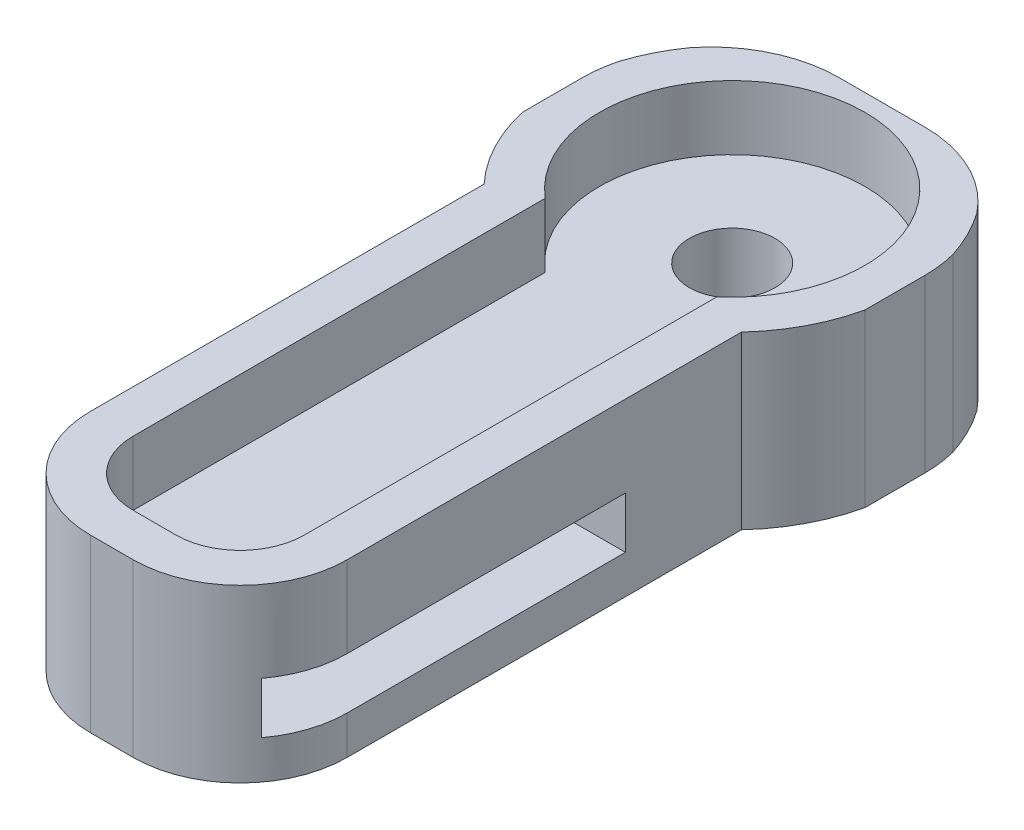
ISO-10303-21;
HEADER;
FILE_DESCRIPTION(('STEP AP214'),'2;1');
FILE_NAME('part.step','',(''),(''),'','','');
FILE_SCHEMA(('AUTOMOTIVE_DESIGN { 1 0 10303 214 1 1 1 1 }'));
ENDSEC;
DATA;
#1=APPLICATION_CONTEXT('core data for automotive mechanical design processes');
#2=APPLICATION_PROTOCOL_DEFINITION('international standard','automotive_design',2000,#1);
#3=PRODUCT_CONTEXT('',#1,'mechanical');
#4=PRODUCT('Part','Part','',(#3));
#5=PRODUCT_RELATED_PRODUCT_CATEGORY('part','',(#4));
#6=PRODUCT_DEFINITION_FORMATION('','',#4);
#7=PRODUCT_DEFINITION_CONTEXT('part definition',#1,'design');
#8=PRODUCT_DEFINITION('design','',#6,#7);
#9=PRODUCT_DEFINITION_SHAPE('','',#8);
#10=(LENGTH_UNIT() NAMED_UNIT(*) SI_UNIT(.MILLI.,.METRE.));
#11=(NAMED_UNIT(*) PLANE_ANGLE_UNIT() SI_UNIT($,.RADIAN.));
#12=(NAMED_UNIT(*) SI_UNIT($,.STERADIAN.) SOLID_ANGLE_UNIT());
#13=UNCERTAINTY_MEASURE_WITH_UNIT(LENGTH_MEASURE(1.E-05),#10,'distance_accuracy_value','');
#14=(GEOMETRIC_REPRESENTATION_CONTEXT(3) GLOBAL_UNCERTAINTY_ASSIGNED_CONTEXT((#13)) GLOBAL_UNIT_ASSIGNED_CONTEXT((#10,
#11,#12)) REPRESENTATION_CONTEXT('',''));
#15=CARTESIAN_POINT('',(0.,0.,0.));
#16=DIRECTION('',(0.,0.,1.));
#17=DIRECTION('',(1.,0.,0.));
#18=AXIS2_PLACEMENT_3D('',#15,#16,#17);
#19=CARTESIAN_POINT('',(4.,4.,9.));
#20=DIRECTION('',(0.,0.,-1.));
#21=DIRECTION('',(-1.,0.,0.));
#22=AXIS2_PLACEMENT_3D('',#19,#20,#21);
#23=PLANE('',#22);
#24=DIRECTION('',(1.,0.,0.));
#25=VECTOR('',#24,1.);
#26=CARTESIAN_POINT('',(4.,0.,9.));
#27=LINE('',#26,#25);
#28=CARTESIAN_POINT('',(-0.494386127514467,0.,9.));
#29=VERTEX_POINT('',#28);
#30=CARTESIAN_POINT('',(0.505613872485533,0.,9.));
#31=VERTEX_POINT('',#30);
#32=EDGE_CURVE('E319',#29,#31,#27,.T.);
#33=ORIENTED_EDGE('',*,*,#32,.T.);
#34=DIRECTION('',(0.,-1.,0.));
#35=VECTOR('',#34,1.);
#36=CARTESIAN_POINT('',(0.505613872485533,34.1246890528022,9.));
#37=LINE('',#36,#35);
#38=CARTESIAN_POINT('',(0.505613872485533,4.,9.));
#39=VERTEX_POINT('',#38);
#40=EDGE_CURVE('E283',#39,#31,#37,.T.);
#41=ORIENTED_EDGE('',*,*,#40,.F.);
#42=DIRECTION('',(1.,0.,0.));
#43=VECTOR('',#42,1.);
#44=CARTESIAN_POINT('',(4.,4.,9.));
#45=LINE('',#44,#43);
#46=CARTESIAN_POINT('',(-0.494386127514467,4.,9.));
#47=VERTEX_POINT('',#46);
#48=EDGE_CURVE('E474',#47,#39,#45,.T.);
#49=ORIENTED_EDGE('',*,*,#48,.F.);
#50=DIRECTION('',(0.,-1.,0.));
#51=VECTOR('',#50,1.);
#52=CARTESIAN_POINT('',(-0.494386127514467,34.1246890528022,9.));
#53=LINE('',#52,#51);
#54=EDGE_CURVE('E247',#47,#29,#53,.T.);
#55=ORIENTED_EDGE('',*,*,#54,.T.);
#56=EDGE_LOOP('',(#33,#41,#49,#55));
#57=FACE_BOUND('',#56,.T.);
#58=ADVANCED_FACE('F39',(#57),#23,.F.);
#59=CARTESIAN_POINT('',(1.,4.,-6.));
#60=DIRECTION('',(0.,-1.,0.));
#61=DIRECTION('',(0.,0.,-1.));
#62=AXIS2_PLACEMENT_3D('',#59,#60,#61);
#63=CYLINDRICAL_SURFACE('',#62,3.);
#64=DIRECTION('',(0.,-1.,0.));
#65=VECTOR('',#64,1.);
#66=CARTESIAN_POINT('',(3.34354322971269,4.,-7.87291354057464));
#67=LINE('',#66,#65);
#68=CARTESIAN_POINT('',(3.34354322971269,0.,-7.87291354057464));
#69=VERTEX_POINT('',#68);
#70=CARTESIAN_POINT('',(3.34354322971269,4.,-7.87291354057464));
#71=VERTEX_POINT('',#70);
#72=EDGE_CURVE('E286',#69,#71,#67,.F.);
#73=ORIENTED_EDGE('',*,*,#72,.F.);
#74=CARTESIAN_POINT('',(1.,0.,-6.));
#75=DIRECTION('',(0.,1.,0.));
#76=DIRECTION('',(0.,0.,1.));
#77=AXIS2_PLACEMENT_3D('',#74,#75,#76);
#78=CIRCLE('',#77,3.);
#79=CARTESIAN_POINT('',(1.,0.,-9.));
#80=VERTEX_POINT('',#79);
#81=EDGE_CURVE('E351',#80,#69,#78,.F.);
#82=ORIENTED_EDGE('',*,*,#81,.F.);
#83=DIRECTION('',(0.,-1.,0.));
#84=VECTOR('',#83,1.);
#85=CARTESIAN_POINT('',(1.,4.,-9.));
#86=LINE('',#85,#84);
#87=CARTESIAN_POINT('',(1.,4.,-9.));
#88=VERTEX_POINT('',#87);
#89=EDGE_CURVE('E342',#88,#80,#86,.T.);
#90=ORIENTED_EDGE('',*,*,#89,.F.);
#91=CARTESIAN_POINT('',(1.,4.,-6.));
#92=DIRECTION('',(0.,1.,0.));
#93=DIRECTION('',(0.,0.,1.));
#94=AXIS2_PLACEMENT_3D('',#91,#92,#93);
#95=CIRCLE('',#94,3.);
#96=EDGE_CURVE('E363',#71,#88,#95,.T.);
#97=ORIENTED_EDGE('',*,*,#96,.F.);
#98=EDGE_LOOP('',(#73,#82,#90,#97));
#99=FACE_BOUND('',#98,.T.);
#100=ADVANCED_FACE('F593',(#99),#63,.T.);
#101=CARTESIAN_POINT('',(-1.,4.,-6.));
#102=DIRECTION('',(0.,-1.,0.));
#103=DIRECTION('',(0.,0.,-1.));
#104=AXIS2_PLACEMENT_3D('',#101,#102,#103);
#105=CYLINDRICAL_SURFACE('',#104,3.);
#106=DIRECTION('',(0.,-1.,0.));
#107=VECTOR('',#106,1.);
#108=CARTESIAN_POINT('',(-3.90445677028733,4.,-6.75108645942533));
#109=LINE('',#108,#107);
#110=CARTESIAN_POINT('',(-3.90445677028733,0.,-6.75108645942533));
#111=VERTEX_POINT('',#110);
#112=CARTESIAN_POINT('',(-3.90445677028733,4.,-6.75108645942533));
#113=VERTEX_POINT('',#112);
#114=EDGE_CURVE('E399',#111,#113,#109,.F.);
#115=ORIENTED_EDGE('',*,*,#114,.F.);
#116=CARTESIAN_POINT('',(-1.,0.,-6.));
#117=DIRECTION('',(0.,1.,0.));
#118=DIRECTION('',(0.,0.,1.));
#119=AXIS2_PLACEMENT_3D('',#116,#117,#118);
#120=CIRCLE('',#119,3.);
#121=CARTESIAN_POINT('',(-4.,0.,-6.));
#122=VERTEX_POINT('',#121);
#123=EDGE_CURVE('E347',#122,#111,#120,.F.);
#124=ORIENTED_EDGE('',*,*,#123,.F.);
#125=DIRECTION('',(0.,-1.,0.));
#126=VECTOR('',#125,1.);
#127=CARTESIAN_POINT('',(-4.,4.,-6.));
#128=LINE('',#127,#126);
#129=CARTESIAN_POINT('',(-4.,4.,-6.));
#130=VERTEX_POINT('',#129);
#131=EDGE_CURVE('E317',#130,#122,#128,.T.);
#132=ORIENTED_EDGE('',*,*,#131,.F.);
#133=CARTESIAN_POINT('',(-1.,4.,-6.));
#134=DIRECTION('',(0.,1.,0.));
#135=DIRECTION('',(0.,0.,1.));
#136=AXIS2_PLACEMENT_3D('',#133,#134,#135);
#137=CIRCLE('',#136,3.);
#138=EDGE_CURVE('E358',#113,#130,#137,.T.);
#139=ORIENTED_EDGE('',*,*,#138,.F.);
#140=EDGE_LOOP('',(#115,#124,#132,#139));
#141=FACE_BOUND('',#140,.T.);
#142=ADVANCED_FACE('F495',(#141),#105,.T.);
#143=CARTESIAN_POINT('',(-4.,4.,9.));
#144=DIRECTION('',(1.,0.,0.));
#145=DIRECTION('',(0.,0.,-1.));
#146=AXIS2_PLACEMENT_3D('',#143,#144,#145);
#147=PLANE('',#146);
#148=DIRECTION('',(0.,0.,1.));
#149=VECTOR('',#148,1.);
#150=CARTESIAN_POINT('',(-4.,0.,9.));
#151=LINE('',#150,#149);
#152=CARTESIAN_POINT('',(-4.,0.,-4.6));
#153=VERTEX_POINT('',#152);
#154=EDGE_CURVE('E311',#122,#153,#151,.T.);
#155=ORIENTED_EDGE('',*,*,#154,.T.);
#156=DIRECTION('',(0.,-1.,0.));
#157=VECTOR('',#156,1.);
#158=CARTESIAN_POINT('',(-4.,34.1246890528022,-4.6));
#159=LINE('',#158,#157);
#160=CARTESIAN_POINT('',(-4.,4.,-4.6));
#161=VERTEX_POINT('',#160);
#162=EDGE_CURVE('E256',#153,#161,#159,.F.);
#163=ORIENTED_EDGE('',*,*,#162,.T.);
#164=DIRECTION('',(0.,0.,1.));
#165=VECTOR('',#164,1.);
#166=CARTESIAN_POINT('',(-4.,4.,9.));
#167=LINE('',#166,#165);
#168=EDGE_CURVE('E253',#130,#161,#167,.T.);
#169=ORIENTED_EDGE('',*,*,#168,.F.);
#170=ORIENTED_EDGE('',*,*,#131,.T.);
#171=EDGE_LOOP('',(#155,#163,#169,#170));
#172=FACE_BOUND('',#171,.T.);
#173=ADVANCED_FACE('F315',(#172),#147,.F.);
#174=CARTESIAN_POINT('',(4.,4.,9.));
#175=DIRECTION('',(-1.,0.,0.));
#176=DIRECTION('',(0.,0.,1.));
#177=AXIS2_PLACEMENT_3D('',#174,#175,#176);
#178=PLANE('',#177);
#179=DIRECTION('',(0.,0.,-1.));
#180=VECTOR('',#179,1.);
#181=CARTESIAN_POINT('',(4.,4.,9.));
#182=LINE('',#181,#180);
#183=CARTESIAN_POINT('',(4.,4.,-4.59999999999999));
#184=VERTEX_POINT('',#183);
#185=CARTESIAN_POINT('',(4.,4.,-6.));
#186=VERTEX_POINT('',#185);
#187=EDGE_CURVE('E477',#184,#186,#182,.T.);
#188=ORIENTED_EDGE('',*,*,#187,.F.);
#189=DIRECTION('',(0.,-1.,0.));
#190=VECTOR('',#189,1.);
#191=CARTESIAN_POINT('',(4.,34.1246890528022,-4.59999999999999));
#192=LINE('',#191,#190);
#193=CARTESIAN_POINT('',(4.,0.,-4.59999999999999));
#194=VERTEX_POINT('',#193);
#195=EDGE_CURVE('E269',#184,#194,#192,.T.);
#196=ORIENTED_EDGE('',*,*,#195,.T.);
#197=DIRECTION('',(0.,0.,-1.));
#198=VECTOR('',#197,1.);
#199=CARTESIAN_POINT('',(4.,0.,9.));
#200=LINE('',#199,#198);
#201=CARTESIAN_POINT('',(4.,0.,-6.));
#202=VERTEX_POINT('',#201);
#203=EDGE_CURVE('E325',#194,#202,#200,.T.);
#204=ORIENTED_EDGE('',*,*,#203,.T.);
#205=DIRECTION('',(0.,-1.,0.));
#206=VECTOR('',#205,1.);
#207=CARTESIAN_POINT('',(4.,4.,-6.));
#208=LINE('',#207,#206);
#209=EDGE_CURVE('E354',#202,#186,#208,.F.);
#210=ORIENTED_EDGE('',*,*,#209,.T.);
#211=EDGE_LOOP('',(#188,#196,#204,#210));
#212=FACE_BOUND('',#211,.T.);
#213=ADVANCED_FACE('F506',(#212),#178,.F.);
#214=CARTESIAN_POINT('',(4.,4.,-9.));
#215=DIRECTION('',(0.,0.,1.));
#216=DIRECTION('',(1.,0.,0.));
#217=AXIS2_PLACEMENT_3D('',#214,#215,#216);
#218=PLANE('',#217);
#219=DIRECTION('',(-1.,0.,0.));
#220=VECTOR('',#219,1.);
#221=CARTESIAN_POINT('',(4.,4.,-9.));
#222=LINE('',#221,#220);
#223=CARTESIAN_POINT('',(-1.,4.,-9.));
#224=VERTEX_POINT('',#223);
#225=EDGE_CURVE('E330',#88,#224,#222,.T.);
#226=ORIENTED_EDGE('',*,*,#225,.F.);
#227=ORIENTED_EDGE('',*,*,#89,.T.);
#228=DIRECTION('',(-1.,0.,0.));
#229=VECTOR('',#228,1.);
#230=CARTESIAN_POINT('',(4.,0.,-9.));
#231=LINE('',#230,#229);
#232=CARTESIAN_POINT('',(-1.,0.,-9.));
#233=VERTEX_POINT('',#232);
#234=EDGE_CURVE('E335',#80,#233,#231,.T.);
#235=ORIENTED_EDGE('',*,*,#234,.T.);
#236=DIRECTION('',(0.,-1.,0.));
#237=VECTOR('',#236,1.);
#238=CARTESIAN_POINT('',(-1.,4.,-9.));
#239=LINE('',#238,#237);
#240=EDGE_CURVE('E339',#233,#224,#239,.F.);
#241=ORIENTED_EDGE('',*,*,#240,.T.);
#242=EDGE_LOOP('',(#226,#227,#235,#241));
#243=FACE_BOUND('',#242,.T.);
#244=ADVANCED_FACE('F641',(#243),#218,.F.);
#245=CARTESIAN_POINT('',(0.,4.,0.));
#246=DIRECTION('',(0.,1.,0.));
#247=DIRECTION('',(0.,0.,1.));
#248=AXIS2_PLACEMENT_3D('',#245,#246,#247);
#249=PLANE('',#248);
#250=CARTESIAN_POINT('',(0.,4.,-5.5));
#251=DIRECTION('',(0.,1.,0.));
#252=DIRECTION('',(0.,0.,1.));
#253=AXIS2_PLACEMENT_3D('',#250,#251,#252);
#254=CIRCLE('',#253,4.1);
#255=CARTESIAN_POINT('',(-3.34354322971267,4.,-7.87291354057466));
#256=VERTEX_POINT('',#255);
#257=EDGE_CURVE('E259',#113,#256,#254,.F.);
#258=ORIENTED_EDGE('',*,*,#257,.F.);
#259=ORIENTED_EDGE('',*,*,#138,.T.);
#260=ORIENTED_EDGE('',*,*,#168,.T.);
#261=CARTESIAN_POINT('',(-2.99438612751447,4.,-2.69934798317447));
#262=VERTEX_POINT('',#261);
#263=EDGE_CURVE('E242',#262,#161,#254,.F.);
#264=ORIENTED_EDGE('',*,*,#263,.F.);
#265=DIRECTION('',(0.,0.,-1.));
#266=VECTOR('',#265,1.);
#267=CARTESIAN_POINT('',(-2.99438612751447,4.,0.));
#268=LINE('',#267,#266);
#269=CARTESIAN_POINT('',(-2.99438612751447,4.,6.5));
#270=VERTEX_POINT('',#269);
#271=EDGE_CURVE('E226',#270,#262,#268,.T.);
#272=ORIENTED_EDGE('',*,*,#271,.F.);
#273=CARTESIAN_POINT('',(-0.494386127514467,4.,6.5));
#274=DIRECTION('',(0.,1.,0.));
#275=DIRECTION('',(0.,0.,1.));
#276=AXIS2_PLACEMENT_3D('',#273,#274,#275);
#277=CIRCLE('',#276,2.5);
#278=EDGE_CURVE('E574',#47,#270,#277,.F.);
#279=ORIENTED_EDGE('',*,*,#278,.F.);
#280=ORIENTED_EDGE('',*,*,#48,.T.);
#281=CARTESIAN_POINT('',(0.505613872485533,4.,6.5));
#282=DIRECTION('',(0.,1.,0.));
#283=DIRECTION('',(0.,0.,1.));
#284=AXIS2_PLACEMENT_3D('',#281,#282,#283);
#285=CIRCLE('',#284,2.5);
#286=CARTESIAN_POINT('',(3.00561387248553,4.,6.5));
#287=VERTEX_POINT('',#286);
#288=EDGE_CURVE('E511',#287,#39,#285,.F.);
#289=ORIENTED_EDGE('',*,*,#288,.F.);
#290=DIRECTION('',(0.,0.,1.));
#291=VECTOR('',#290,1.);
#292=CARTESIAN_POINT('',(3.00561387248553,4.,0.));
#293=LINE('',#292,#291);
#294=CARTESIAN_POINT('',(3.00561387248553,4.,-2.71140084459553));
#295=VERTEX_POINT('',#294);
#296=EDGE_CURVE('E510',#295,#287,#293,.T.);
#297=ORIENTED_EDGE('',*,*,#296,.F.);
#298=EDGE_CURVE('E258',#184,#295,#254,.F.);
#299=ORIENTED_EDGE('',*,*,#298,.F.);
#300=ORIENTED_EDGE('',*,*,#187,.T.);
#301=CARTESIAN_POINT('',(3.90445677028732,4.,-6.75108645942537));
#302=VERTEX_POINT('',#301);
#303=EDGE_CURVE('E364',#186,#302,#95,.T.);
#304=ORIENTED_EDGE('',*,*,#303,.T.);
#305=EDGE_CURVE('E270',#71,#302,#254,.F.);
#306=ORIENTED_EDGE('',*,*,#305,.F.);
#307=ORIENTED_EDGE('',*,*,#96,.T.);
#308=ORIENTED_EDGE('',*,*,#225,.T.);
#309=EDGE_CURVE('E359',#224,#256,#137,.T.);
#310=ORIENTED_EDGE('',*,*,#309,.T.);
#311=EDGE_LOOP('',(#258,#259,#260,#264,#272,#279,#280,#289,#297,#299,#300,#304,#306,#307,#308,#310));
#312=FACE_BOUND('',#311,.T.);
#313=DIRECTION('',(0.,0.,-1.));
#314=VECTOR('',#313,1.);
#315=CARTESIAN_POINT('',(2.00561387248553,4.,8.));
#316=LINE('',#315,#314);
#317=CARTESIAN_POINT('',(2.00561387248553,4.,6.5));
#318=VERTEX_POINT('',#317);
#319=CARTESIAN_POINT('',(2.00561387248553,4.,-3.13620792062974));
#320=VERTEX_POINT('',#319);
#321=EDGE_CURVE('E455',#318,#320,#316,.T.);
#322=ORIENTED_EDGE('',*,*,#321,.F.);
#323=CARTESIAN_POINT('',(0.505613872485533,4.,6.5));
#324=DIRECTION('',(0.,1.,0.));
#325=DIRECTION('',(0.,0.,1.));
#326=AXIS2_PLACEMENT_3D('',#323,#324,#325);
#327=CIRCLE('',#326,1.5);
#328=CARTESIAN_POINT('',(0.505613872485533,4.,8.));
#329=VERTEX_POINT('',#328);
#330=EDGE_CURVE('E393',#318,#329,#327,.F.);
#331=ORIENTED_EDGE('',*,*,#330,.T.);
#332=DIRECTION('',(1.,0.,0.));
#333=VECTOR('',#332,1.);
#334=CARTESIAN_POINT('',(2.00561387248553,4.,8.));
#335=LINE('',#334,#333);
#336=CARTESIAN_POINT('',(-0.494386127514467,4.,8.));
#337=VERTEX_POINT('',#336);
#338=EDGE_CURVE('E443',#337,#329,#335,.T.);
#339=ORIENTED_EDGE('',*,*,#338,.F.);
#340=CARTESIAN_POINT('',(-0.494386127514467,4.,6.5));
#341=DIRECTION('',(0.,1.,0.));
#342=DIRECTION('',(0.,0.,1.));
#343=AXIS2_PLACEMENT_3D('',#340,#341,#342);
#344=CIRCLE('',#343,1.5);
#345=CARTESIAN_POINT('',(-1.99438612751447,4.,6.5));
#346=VERTEX_POINT('',#345);
#347=EDGE_CURVE('E390',#337,#346,#344,.F.);
#348=ORIENTED_EDGE('',*,*,#347,.T.);
#349=DIRECTION('',(0.,0.,1.));
#350=VECTOR('',#349,1.);
#351=CARTESIAN_POINT('',(-1.99438612751447,4.,8.));
#352=LINE('',#351,#350);
#353=CARTESIAN_POINT('',(-1.99438612751447,4.,-3.12672715972692));
#354=VERTEX_POINT('',#353);
#355=EDGE_CURVE('E462',#354,#346,#352,.T.);
#356=ORIENTED_EDGE('',*,*,#355,.F.);
#357=CARTESIAN_POINT('',(0.,4.,-5.5));
#358=DIRECTION('',(0.,1.,0.));
#359=DIRECTION('',(0.,0.,1.));
#360=AXIS2_PLACEMENT_3D('',#357,#358,#359);
#361=CIRCLE('',#360,3.1);
#362=EDGE_CURVE('E458',#320,#354,#361,.T.);
#363=ORIENTED_EDGE('',*,*,#362,.F.);
#364=EDGE_LOOP('',(#322,#331,#339,#348,#356,#363));
#365=FACE_BOUND('',#364,.T.);
#366=ADVANCED_FACE('F250',(#312,#365),#249,.T.);
#367=CARTESIAN_POINT('',(0.,0.,0.));
#368=DIRECTION('',(0.,1.,0.));
#369=DIRECTION('',(0.,0.,1.));
#370=AXIS2_PLACEMENT_3D('',#367,#368,#369);
#371=PLANE('',#370);
#372=CARTESIAN_POINT('',(0.,0.,-5.5));
#373=DIRECTION('',(0.,1.,0.));
#374=DIRECTION('',(0.,0.,1.));
#375=AXIS2_PLACEMENT_3D('',#372,#373,#374);
#376=CIRCLE('',#375,1.);
#377=CARTESIAN_POINT('',(0.,0.,-4.5));
#378=VERTEX_POINT('',#377);
#379=EDGE_CURVE('E435',#378,#378,#376,.T.);
#380=ORIENTED_EDGE('',*,*,#379,.T.);
#381=EDGE_LOOP('',(#380));
#382=FACE_BOUND('',#381,.T.);
#383=ORIENTED_EDGE('',*,*,#123,.T.);
#384=CARTESIAN_POINT('',(0.,0.,-5.5));
#385=DIRECTION('',(0.,1.,0.));
#386=DIRECTION('',(0.,0.,1.));
#387=AXIS2_PLACEMENT_3D('',#384,#385,#386);
#388=CIRCLE('',#387,4.1);
#389=CARTESIAN_POINT('',(-3.34354322971267,0.,-7.87291354057466));
#390=VERTEX_POINT('',#389);
#391=EDGE_CURVE('E274',#111,#390,#388,.F.);
#392=ORIENTED_EDGE('',*,*,#391,.T.);
#393=EDGE_CURVE('E346',#390,#233,#120,.F.);
#394=ORIENTED_EDGE('',*,*,#393,.T.);
#395=ORIENTED_EDGE('',*,*,#234,.F.);
#396=ORIENTED_EDGE('',*,*,#81,.T.);
#397=CARTESIAN_POINT('',(3.90445677028732,0.,-6.75108645942537));
#398=VERTEX_POINT('',#397);
#399=EDGE_CURVE('E281',#69,#398,#388,.F.);
#400=ORIENTED_EDGE('',*,*,#399,.T.);
#401=EDGE_CURVE('E350',#398,#202,#78,.F.);
#402=ORIENTED_EDGE('',*,*,#401,.T.);
#403=ORIENTED_EDGE('',*,*,#203,.F.);
#404=CARTESIAN_POINT('',(3.00561387248553,0.,-2.71140084459553));
#405=VERTEX_POINT('',#404);
#406=EDGE_CURVE('E291',#194,#405,#388,.F.);
#407=ORIENTED_EDGE('',*,*,#406,.T.);
#408=DIRECTION('',(0.,0.,1.));
#409=VECTOR('',#408,1.);
#410=CARTESIAN_POINT('',(3.00561387248553,0.,0.));
#411=LINE('',#410,#409);
#412=CARTESIAN_POINT('',(3.00561387248553,0.,6.5));
#413=VERTEX_POINT('',#412);
#414=EDGE_CURVE('E516',#405,#413,#411,.T.);
#415=ORIENTED_EDGE('',*,*,#414,.T.);
#416=CARTESIAN_POINT('',(0.505613872485533,0.,6.5));
#417=DIRECTION('',(0.,1.,0.));
#418=DIRECTION('',(0.,0.,1.));
#419=AXIS2_PLACEMENT_3D('',#416,#417,#418);
#420=CIRCLE('',#419,2.5);
#421=EDGE_CURVE('E530',#413,#31,#420,.F.);
#422=ORIENTED_EDGE('',*,*,#421,.T.);
#423=ORIENTED_EDGE('',*,*,#32,.F.);
#424=CARTESIAN_POINT('',(-0.494386127514467,0.,6.5));
#425=DIRECTION('',(0.,1.,0.));
#426=DIRECTION('',(0.,0.,1.));
#427=AXIS2_PLACEMENT_3D('',#424,#425,#426);
#428=CIRCLE('',#427,2.5);
#429=CARTESIAN_POINT('',(-2.99438612751447,0.,6.5));
#430=VERTEX_POINT('',#429);
#431=EDGE_CURVE('E576',#29,#430,#428,.F.);
#432=ORIENTED_EDGE('',*,*,#431,.T.);
#433=DIRECTION('',(0.,0.,-1.));
#434=VECTOR('',#433,1.);
#435=CARTESIAN_POINT('',(-2.99438612751447,0.,0.));
#436=LINE('',#435,#434);
#437=CARTESIAN_POINT('',(-2.99438612751447,0.,-2.69934798317447));
#438=VERTEX_POINT('',#437);
#439=EDGE_CURVE('E238',#430,#438,#436,.T.);
#440=ORIENTED_EDGE('',*,*,#439,.T.);
#441=EDGE_CURVE('E245',#438,#153,#388,.F.);
#442=ORIENTED_EDGE('',*,*,#441,.T.);
#443=ORIENTED_EDGE('',*,*,#154,.F.);
#444=EDGE_LOOP('',(#383,#392,#394,#395,#396,#400,#402,#403,#407,#415,#422,#423,#432,#440,#442,#443));
#445=FACE_BOUND('',#444,.T.);
#446=ADVANCED_FACE('F310',(#382,#445),#371,.F.);
#447=CARTESIAN_POINT('',(2.00561387248553,2.5,8.));
#448=DIRECTION('',(1.,0.,0.));
#449=DIRECTION('',(0.,0.,-1.));
#450=AXIS2_PLACEMENT_3D('',#447,#448,#449);
#451=PLANE('',#450);
#452=DIRECTION('',(0.,0.,-1.));
#453=VECTOR('',#452,1.);
#454=CARTESIAN_POINT('',(2.00561387248553,2.5,8.));
#455=LINE('',#454,#453);
#456=CARTESIAN_POINT('',(2.00561387248553,2.5,6.5));
#457=VERTEX_POINT('',#456);
#458=CARTESIAN_POINT('',(2.00561387248553,2.5,-3.13620792062974));
#459=VERTEX_POINT('',#458);
#460=EDGE_CURVE('E439',#457,#459,#455,.T.);
#461=ORIENTED_EDGE('',*,*,#460,.F.);
#462=DIRECTION('',(0.,1.,0.));
#463=VECTOR('',#462,1.);
#464=CARTESIAN_POINT('',(2.00561387248553,4.,6.5));
#465=LINE('',#464,#463);
#466=EDGE_CURVE('E386',#457,#318,#465,.T.);
#467=ORIENTED_EDGE('',*,*,#466,.T.);
#468=ORIENTED_EDGE('',*,*,#321,.T.);
#469=DIRECTION('',(0.,1.,0.));
#470=VECTOR('',#469,1.);
#471=CARTESIAN_POINT('',(2.00561387248553,2.5,-3.13620792062974));
#472=LINE('',#471,#470);
#473=EDGE_CURVE('E327',#459,#320,#472,.T.);
#474=ORIENTED_EDGE('',*,*,#473,.F.);
#475=EDGE_LOOP('',(#461,#467,#468,#474));
#476=FACE_BOUND('',#475,.T.);
#477=ADVANCED_FACE('F631',(#476),#451,.F.);
#478=CARTESIAN_POINT('',(2.00561387248553,2.5,8.));
#479=DIRECTION('',(0.,0.,1.));
#480=DIRECTION('',(1.,0.,0.));
#481=AXIS2_PLACEMENT_3D('',#478,#479,#480);
#482=PLANE('',#481);
#483=DIRECTION('',(1.,0.,0.));
#484=VECTOR('',#483,1.);
#485=CARTESIAN_POINT('',(2.00561387248553,2.5,8.));
#486=LINE('',#485,#484);
#487=CARTESIAN_POINT('',(-0.494386127514467,2.5,8.));
#488=VERTEX_POINT('',#487);
#489=CARTESIAN_POINT('',(0.505613872485533,2.5,8.));
#490=VERTEX_POINT('',#489);
#491=EDGE_CURVE('E451',#488,#490,#486,.T.);
#492=ORIENTED_EDGE('',*,*,#491,.F.);
#493=DIRECTION('',(0.,1.,0.));
#494=VECTOR('',#493,1.);
#495=CARTESIAN_POINT('',(-0.494386127514467,4.,8.));
#496=LINE('',#495,#494);
#497=EDGE_CURVE('E373',#488,#337,#496,.T.);
#498=ORIENTED_EDGE('',*,*,#497,.T.);
#499=ORIENTED_EDGE('',*,*,#338,.T.);
#500=DIRECTION('',(0.,1.,0.));
#501=VECTOR('',#500,1.);
#502=CARTESIAN_POINT('',(0.505613872485533,2.5,8.));
#503=LINE('',#502,#501);
#504=EDGE_CURVE('E370',#329,#490,#503,.F.);
#505=ORIENTED_EDGE('',*,*,#504,.T.);
#506=EDGE_LOOP('',(#492,#498,#499,#505));
#507=FACE_BOUND('',#506,.T.);
#508=ADVANCED_FACE('F624',(#507),#482,.F.);
#509=CARTESIAN_POINT('',(-1.99438612751447,2.5,8.));
#510=DIRECTION('',(-1.,0.,0.));
#511=DIRECTION('',(0.,0.,1.));
#512=AXIS2_PLACEMENT_3D('',#509,#510,#511);
#513=PLANE('',#512);
#514=ORIENTED_EDGE('',*,*,#355,.T.);
#515=DIRECTION('',(0.,1.,0.));
#516=VECTOR('',#515,1.);
#517=CARTESIAN_POINT('',(-1.99438612751447,2.5,6.5));
#518=LINE('',#517,#516);
#519=CARTESIAN_POINT('',(-1.99438612751447,2.5,6.5));
#520=VERTEX_POINT('',#519);
#521=EDGE_CURVE('E377',#346,#520,#518,.F.);
#522=ORIENTED_EDGE('',*,*,#521,.T.);
#523=DIRECTION('',(0.,0.,1.));
#524=VECTOR('',#523,1.);
#525=CARTESIAN_POINT('',(-1.99438612751447,2.5,8.));
#526=LINE('',#525,#524);
#527=CARTESIAN_POINT('',(-1.99438612751447,2.5,-3.12672715972692));
#528=VERTEX_POINT('',#527);
#529=EDGE_CURVE('E447',#528,#520,#526,.T.);
#530=ORIENTED_EDGE('',*,*,#529,.F.);
#531=DIRECTION('',(0.,1.,0.));
#532=VECTOR('',#531,1.);
#533=CARTESIAN_POINT('',(-1.99438612751447,2.5,-3.12672715972692));
#534=LINE('',#533,#532);
#535=EDGE_CURVE('E320',#528,#354,#534,.T.);
#536=ORIENTED_EDGE('',*,*,#535,.T.);
#537=EDGE_LOOP('',(#514,#522,#530,#536));
#538=FACE_BOUND('',#537,.T.);
#539=ADVANCED_FACE('F639',(#538),#513,.F.);
#540=CARTESIAN_POINT('',(0.,2.5,-5.5));
#541=DIRECTION('',(0.,1.,0.));
#542=DIRECTION('',(0.,0.,1.));
#543=AXIS2_PLACEMENT_3D('',#540,#541,#542);
#544=CYLINDRICAL_SURFACE('',#543,3.1);
#545=ORIENTED_EDGE('',*,*,#362,.T.);
#546=ORIENTED_EDGE('',*,*,#535,.F.);
#547=CARTESIAN_POINT('',(0.,2.5,-5.5));
#548=DIRECTION('',(0.,1.,0.));
#549=DIRECTION('',(0.,0.,1.));
#550=AXIS2_PLACEMENT_3D('',#547,#548,#549);
#551=CIRCLE('',#550,3.1);
#552=EDGE_CURVE('E442',#459,#528,#551,.T.);
#553=ORIENTED_EDGE('',*,*,#552,.F.);
#554=ORIENTED_EDGE('',*,*,#473,.T.);
#555=EDGE_LOOP('',(#545,#546,#553,#554));
#556=FACE_BOUND('',#555,.T.);
#557=ADVANCED_FACE('F636',(#556),#544,.F.);
#558=CARTESIAN_POINT('',(0.,2.5,-5.5));
#559=DIRECTION('',(0.,1.,0.));
#560=DIRECTION('',(0.,0.,1.));
#561=AXIS2_PLACEMENT_3D('',#558,#559,#560);
#562=PLANE('',#561);
#563=CARTESIAN_POINT('',(0.,2.5,-5.5));
#564=DIRECTION('',(0.,1.,0.));
#565=DIRECTION('',(0.,0.,1.));
#566=AXIS2_PLACEMENT_3D('',#563,#564,#565);
#567=CIRCLE('',#566,1.);
#568=CARTESIAN_POINT('',(0.,2.5,-4.5));
#569=VERTEX_POINT('',#568);
#570=EDGE_CURVE('E536',#569,#569,#567,.T.);
#571=ORIENTED_EDGE('',*,*,#570,.F.);
#572=EDGE_LOOP('',(#571));
#573=FACE_BOUND('',#572,.T.);
#574=ORIENTED_EDGE('',*,*,#529,.T.);
#575=CARTESIAN_POINT('',(-0.494386127514467,2.5,6.5));
#576=DIRECTION('',(0.,1.,0.));
#577=DIRECTION('',(0.,0.,1.));
#578=AXIS2_PLACEMENT_3D('',#575,#576,#577);
#579=CIRCLE('',#578,1.5);
#580=EDGE_CURVE('E383',#520,#488,#579,.T.);
#581=ORIENTED_EDGE('',*,*,#580,.T.);
#582=ORIENTED_EDGE('',*,*,#491,.T.);
#583=CARTESIAN_POINT('',(0.505613872485533,2.5,6.5));
#584=DIRECTION('',(0.,1.,0.));
#585=DIRECTION('',(0.,0.,1.));
#586=AXIS2_PLACEMENT_3D('',#583,#584,#585);
#587=CIRCLE('',#586,1.5);
#588=EDGE_CURVE('E380',#490,#457,#587,.T.);
#589=ORIENTED_EDGE('',*,*,#588,.T.);
#590=ORIENTED_EDGE('',*,*,#460,.T.);
#591=ORIENTED_EDGE('',*,*,#552,.T.);
#592=EDGE_LOOP('',(#574,#581,#582,#589,#590,#591));
#593=FACE_BOUND('',#592,.T.);
#594=ADVANCED_FACE('F620',(#573,#593),#562,.T.);
#595=CARTESIAN_POINT('',(0.,0.,-5.5));
#596=DIRECTION('',(0.,1.,0.));
#597=DIRECTION('',(0.,0.,1.));
#598=AXIS2_PLACEMENT_3D('',#595,#596,#597);
#599=CYLINDRICAL_SURFACE('',#598,1.);
#600=ORIENTED_EDGE('',*,*,#379,.F.);
#601=EDGE_LOOP('',(#600));
#602=FACE_BOUND('',#601,.T.);
#603=ORIENTED_EDGE('',*,*,#570,.T.);
#604=EDGE_LOOP('',(#603));
#605=FACE_BOUND('',#604,.T.);
#606=ADVANCED_FACE('F606',(#602,#605),#599,.F.);
#607=DIRECTION('',(0.,-1.,0.));
#608=VECTOR('',#607,1.);
#609=CARTESIAN_POINT('',(3.90445677028732,4.,-6.75108645942537));
#610=LINE('',#609,#608);
#611=EDGE_CURVE('E273',#302,#398,#610,.T.);
#612=ORIENTED_EDGE('',*,*,#611,.F.);
#613=ORIENTED_EDGE('',*,*,#303,.F.);
#614=ORIENTED_EDGE('',*,*,#209,.F.);
#615=ORIENTED_EDGE('',*,*,#401,.F.);
#616=EDGE_LOOP('',(#612,#613,#614,#615));
#617=FACE_BOUND('',#616,.T.);
#618=ADVANCED_FACE('F504',(#617),#63,.T.);
#619=DIRECTION('',(0.,-1.,0.));
#620=VECTOR('',#619,1.);
#621=CARTESIAN_POINT('',(-3.34354322971267,4.,-7.87291354057466));
#622=LINE('',#621,#620);
#623=EDGE_CURVE('E396',#256,#390,#622,.T.);
#624=ORIENTED_EDGE('',*,*,#623,.F.);
#625=ORIENTED_EDGE('',*,*,#309,.F.);
#626=ORIENTED_EDGE('',*,*,#240,.F.);
#627=ORIENTED_EDGE('',*,*,#393,.F.);
#628=EDGE_LOOP('',(#624,#625,#626,#627));
#629=FACE_BOUND('',#628,.T.);
#630=ADVANCED_FACE('F490',(#629),#105,.T.);
#631=CARTESIAN_POINT('',(-0.494386127514467,2.5,6.5));
#632=DIRECTION('',(0.,-1.,0.));
#633=DIRECTION('',(0.,0.,-1.));
#634=AXIS2_PLACEMENT_3D('',#631,#632,#633);
#635=CYLINDRICAL_SURFACE('',#634,1.5);
#636=ORIENTED_EDGE('',*,*,#580,.F.);
#637=ORIENTED_EDGE('',*,*,#521,.F.);
#638=ORIENTED_EDGE('',*,*,#347,.F.);
#639=ORIENTED_EDGE('',*,*,#497,.F.);
#640=EDGE_LOOP('',(#636,#637,#638,#639));
#641=FACE_BOUND('',#640,.T.);
#642=ADVANCED_FACE('F608',(#641),#635,.F.);
#643=CARTESIAN_POINT('',(0.505613872485533,2.5,6.5));
#644=DIRECTION('',(0.,-1.,0.));
#645=DIRECTION('',(0.,0.,-1.));
#646=AXIS2_PLACEMENT_3D('',#643,#644,#645);
#647=CYLINDRICAL_SURFACE('',#646,1.5);
#648=ORIENTED_EDGE('',*,*,#588,.F.);
#649=ORIENTED_EDGE('',*,*,#504,.F.);
#650=ORIENTED_EDGE('',*,*,#330,.F.);
#651=ORIENTED_EDGE('',*,*,#466,.F.);
#652=EDGE_LOOP('',(#648,#649,#650,#651));
#653=FACE_BOUND('',#652,.T.);
#654=ADVANCED_FACE('F41',(#653),#647,.F.);
#655=CARTESIAN_POINT('',(0.,34.1246890528022,-5.5));
#656=DIRECTION('',(0.,-1.,0.));
#657=DIRECTION('',(0.,0.,-1.));
#658=AXIS2_PLACEMENT_3D('',#655,#656,#657);
#659=CYLINDRICAL_SURFACE('',#658,4.1);
#660=ORIENTED_EDGE('',*,*,#391,.F.);
#661=ORIENTED_EDGE('',*,*,#114,.T.);
#662=ORIENTED_EDGE('',*,*,#257,.T.);
#663=ORIENTED_EDGE('',*,*,#623,.T.);
#664=EDGE_LOOP('',(#660,#661,#662,#663));
#665=FACE_BOUND('',#664,.T.);
#666=ADVANCED_FACE('F492',(#665),#659,.T.);
#667=ORIENTED_EDGE('',*,*,#399,.F.);
#668=ORIENTED_EDGE('',*,*,#72,.T.);
#669=ORIENTED_EDGE('',*,*,#305,.T.);
#670=ORIENTED_EDGE('',*,*,#611,.T.);
#671=EDGE_LOOP('',(#667,#668,#669,#670));
#672=FACE_BOUND('',#671,.T.);
#673=ADVANCED_FACE('F678',(#672),#659,.T.);
#674=CARTESIAN_POINT('',(-0.494386127514467,34.1246890528022,6.5));
#675=DIRECTION('',(0.,-1.,0.));
#676=DIRECTION('',(0.,0.,-1.));
#677=AXIS2_PLACEMENT_3D('',#674,#675,#676);
#678=CYLINDRICAL_SURFACE('',#677,2.5);
#679=ORIENTED_EDGE('',*,*,#54,.F.);
#680=ORIENTED_EDGE('',*,*,#278,.T.);
#681=DIRECTION('',(0.,-1.,0.));
#682=VECTOR('',#681,1.);
#683=CARTESIAN_POINT('',(-2.99438612751447,34.1246890528022,6.5));
#684=LINE('',#683,#682);
#685=CARTESIAN_POINT('',(-2.99438612751447,2.1,6.5));
#686=VERTEX_POINT('',#685);
#687=EDGE_CURVE('E232',#270,#686,#684,.T.);
#688=ORIENTED_EDGE('',*,*,#687,.T.);
#689=CARTESIAN_POINT('',(-0.494386127514467,2.1,6.5));
#690=DIRECTION('',(0.,1.,0.));
#691=DIRECTION('',(0.,0.,1.));
#692=AXIS2_PLACEMENT_3D('',#689,#690,#691);
#693=CIRCLE('',#692,2.5);
#694=CARTESIAN_POINT('',(-2.49438612751447,2.1,8.));
#695=VERTEX_POINT('',#694);
#696=EDGE_CURVE('E263',#695,#686,#693,.F.);
#697=ORIENTED_EDGE('',*,*,#696,.F.);
#698=DIRECTION('',(0.,-1.,0.));
#699=VECTOR('',#698,1.);
#700=CARTESIAN_POINT('',(-2.49438612751447,34.1246890528022,8.));
#701=LINE('',#700,#699);
#702=CARTESIAN_POINT('',(-2.49438612751447,0.899999999999998,8.));
#703=VERTEX_POINT('',#702);
#704=EDGE_CURVE('E255',#703,#695,#701,.F.);
#705=ORIENTED_EDGE('',*,*,#704,.F.);
#706=CARTESIAN_POINT('',(-0.494386127514467,0.899999999999998,6.5));
#707=DIRECTION('',(0.,-1.,0.));
#708=DIRECTION('',(0.,0.,-1.));
#709=AXIS2_PLACEMENT_3D('',#706,#707,#708);
#710=CIRCLE('',#709,2.5);
#711=CARTESIAN_POINT('',(-2.99438612751447,0.899999999999998,6.5));
#712=VERTEX_POINT('',#711);
#713=EDGE_CURVE('E402',#712,#703,#710,.F.);
#714=ORIENTED_EDGE('',*,*,#713,.F.);
#715=EDGE_CURVE('E63',#712,#430,#684,.T.);
#716=ORIENTED_EDGE('',*,*,#715,.T.);
#717=ORIENTED_EDGE('',*,*,#431,.F.);
#718=EDGE_LOOP('',(#679,#680,#688,#697,#705,#714,#716,#717));
#719=FACE_BOUND('',#718,.T.);
#720=ADVANCED_FACE('F573',(#719),#678,.T.);
#721=CARTESIAN_POINT('',(-2.99438612751447,34.1246890528022,-2.69934798317447));
#722=DIRECTION('',(1.,0.,0.));
#723=DIRECTION('',(0.,0.,-1.));
#724=AXIS2_PLACEMENT_3D('',#721,#722,#723);
#725=PLANE('',#724);
#726=ORIENTED_EDGE('',*,*,#687,.F.);
#727=ORIENTED_EDGE('',*,*,#271,.T.);
#728=DIRECTION('',(0.,-1.,0.));
#729=VECTOR('',#728,1.);
#730=CARTESIAN_POINT('',(-2.99438612751447,34.1246890528022,-2.69934798317447));
#731=LINE('',#730,#729);
#732=EDGE_CURVE('E229',#262,#438,#731,.T.);
#733=ORIENTED_EDGE('',*,*,#732,.T.);
#734=ORIENTED_EDGE('',*,*,#439,.F.);
#735=ORIENTED_EDGE('',*,*,#715,.F.);
#736=DIRECTION('',(0.,0.,1.));
#737=VECTOR('',#736,1.);
#738=CARTESIAN_POINT('',(-2.99438612751447,0.900000000000001,0.));
#739=LINE('',#738,#737);
#740=CARTESIAN_POINT('',(-2.99438612751447,0.900000000000001,0.));
#741=VERTEX_POINT('',#740);
#742=EDGE_CURVE('E406',#741,#712,#739,.T.);
#743=ORIENTED_EDGE('',*,*,#742,.F.);
#744=DIRECTION('',(0.,-1.,0.));
#745=VECTOR('',#744,1.);
#746=CARTESIAN_POINT('',(-2.99438612751447,0.900000000000001,0.));
#747=LINE('',#746,#745);
#748=CARTESIAN_POINT('',(-2.99438612751447,2.1,0.));
#749=VERTEX_POINT('',#748);
#750=EDGE_CURVE('E426',#749,#741,#747,.T.);
#751=ORIENTED_EDGE('',*,*,#750,.F.);
#752=DIRECTION('',(0.,0.,-1.));
#753=VECTOR('',#752,1.);
#754=CARTESIAN_POINT('',(-2.99438612751447,2.1,0.));
#755=LINE('',#754,#753);
#756=EDGE_CURVE('E580',#686,#749,#755,.T.);
#757=ORIENTED_EDGE('',*,*,#756,.F.);
#758=EDGE_LOOP('',(#726,#727,#733,#734,#735,#743,#751,#757));
#759=FACE_BOUND('',#758,.T.);
#760=ADVANCED_FACE('F228',(#759),#725,.F.);
#761=ORIENTED_EDGE('',*,*,#732,.F.);
#762=ORIENTED_EDGE('',*,*,#263,.T.);
#763=ORIENTED_EDGE('',*,*,#162,.F.);
#764=ORIENTED_EDGE('',*,*,#441,.F.);
#765=EDGE_LOOP('',(#761,#762,#763,#764));
#766=FACE_BOUND('',#765,.T.);
#767=ADVANCED_FACE('F241',(#766),#659,.T.);
#768=CARTESIAN_POINT('',(0.505613872485533,34.1246890528022,6.5));
#769=DIRECTION('',(0.,-1.,0.));
#770=DIRECTION('',(0.,0.,-1.));
#771=AXIS2_PLACEMENT_3D('',#768,#769,#770);
#772=CYLINDRICAL_SURFACE('',#771,2.5);
#773=DIRECTION('',(0.,-1.,0.));
#774=VECTOR('',#773,1.);
#775=CARTESIAN_POINT('',(3.00561387248553,34.1246890528022,6.5));
#776=LINE('',#775,#774);
#777=CARTESIAN_POINT('',(3.00561387248553,2.1,6.5));
#778=VERTEX_POINT('',#777);
#779=EDGE_CURVE('E555',#287,#778,#776,.T.);
#780=ORIENTED_EDGE('',*,*,#779,.F.);
#781=ORIENTED_EDGE('',*,*,#288,.T.);
#782=ORIENTED_EDGE('',*,*,#40,.T.);
#783=ORIENTED_EDGE('',*,*,#421,.F.);
#784=CARTESIAN_POINT('',(3.00561387248553,0.899999999999998,6.5));
#785=VERTEX_POINT('',#784);
#786=EDGE_CURVE('E558',#785,#413,#776,.T.);
#787=ORIENTED_EDGE('',*,*,#786,.F.);
#788=CARTESIAN_POINT('',(0.505613872485533,0.899999999999998,6.5));
#789=DIRECTION('',(0.,-1.,0.));
#790=DIRECTION('',(0.,0.,-1.));
#791=AXIS2_PLACEMENT_3D('',#788,#789,#790);
#792=CIRCLE('',#791,2.5);
#793=CARTESIAN_POINT('',(2.50561387248553,0.899999999999998,8.));
#794=VERTEX_POINT('',#793);
#795=EDGE_CURVE('E11',#794,#785,#792,.F.);
#796=ORIENTED_EDGE('',*,*,#795,.F.);
#797=DIRECTION('',(0.,-1.,0.));
#798=VECTOR('',#797,1.);
#799=CARTESIAN_POINT('',(2.50561387248553,34.1246890528022,8.));
#800=LINE('',#799,#798);
#801=CARTESIAN_POINT('',(2.50561387248553,2.1,8.));
#802=VERTEX_POINT('',#801);
#803=EDGE_CURVE('E515',#802,#794,#800,.T.);
#804=ORIENTED_EDGE('',*,*,#803,.F.);
#805=CARTESIAN_POINT('',(0.505613872485533,2.1,6.5));
#806=DIRECTION('',(0.,1.,0.));
#807=DIRECTION('',(0.,0.,1.));
#808=AXIS2_PLACEMENT_3D('',#805,#806,#807);
#809=CIRCLE('',#808,2.5);
#810=EDGE_CURVE('E521',#778,#802,#809,.F.);
#811=ORIENTED_EDGE('',*,*,#810,.F.);
#812=EDGE_LOOP('',(#780,#781,#782,#783,#787,#796,#804,#811));
#813=FACE_BOUND('',#812,.T.);
#814=ADVANCED_FACE('F554',(#813),#772,.T.);
#815=CARTESIAN_POINT('',(3.00561387248553,34.1246890528022,6.5));
#816=DIRECTION('',(-1.,0.,0.));
#817=DIRECTION('',(0.,0.,1.));
#818=AXIS2_PLACEMENT_3D('',#815,#816,#817);
#819=PLANE('',#818);
#820=DIRECTION('',(0.,-1.,0.));
#821=VECTOR('',#820,1.);
#822=CARTESIAN_POINT('',(3.00561387248553,34.1246890528022,-2.71140084459553));
#823=LINE('',#822,#821);
#824=EDGE_CURVE('E55',#295,#405,#823,.T.);
#825=ORIENTED_EDGE('',*,*,#824,.F.);
#826=ORIENTED_EDGE('',*,*,#296,.T.);
#827=ORIENTED_EDGE('',*,*,#779,.T.);
#828=DIRECTION('',(0.,0.,1.));
#829=VECTOR('',#828,1.);
#830=CARTESIAN_POINT('',(3.00561387248553,2.1,0.));
#831=LINE('',#830,#829);
#832=CARTESIAN_POINT('',(3.00561387248553,2.1,0.));
#833=VERTEX_POINT('',#832);
#834=EDGE_CURVE('E523',#833,#778,#831,.T.);
#835=ORIENTED_EDGE('',*,*,#834,.F.);
#836=DIRECTION('',(0.,1.,0.));
#837=VECTOR('',#836,1.);
#838=CARTESIAN_POINT('',(3.00561387248553,0.900000000000001,0.));
#839=LINE('',#838,#837);
#840=CARTESIAN_POINT('',(3.00561387248553,0.900000000000001,0.));
#841=VERTEX_POINT('',#840);
#842=EDGE_CURVE('E237',#841,#833,#839,.T.);
#843=ORIENTED_EDGE('',*,*,#842,.F.);
#844=DIRECTION('',(0.,0.,-1.));
#845=VECTOR('',#844,1.);
#846=CARTESIAN_POINT('',(3.00561387248553,0.900000000000001,0.));
#847=LINE('',#846,#845);
#848=EDGE_CURVE('E48',#785,#841,#847,.T.);
#849=ORIENTED_EDGE('',*,*,#848,.F.);
#850=ORIENTED_EDGE('',*,*,#786,.T.);
#851=ORIENTED_EDGE('',*,*,#414,.F.);
#852=EDGE_LOOP('',(#825,#826,#827,#835,#843,#849,#850,#851));
#853=FACE_BOUND('',#852,.T.);
#854=ADVANCED_FACE('F556',(#853),#819,.F.);
#855=ORIENTED_EDGE('',*,*,#195,.F.);
#856=ORIENTED_EDGE('',*,*,#298,.T.);
#857=ORIENTED_EDGE('',*,*,#824,.T.);
#858=ORIENTED_EDGE('',*,*,#406,.F.);
#859=EDGE_LOOP('',(#855,#856,#857,#858));
#860=FACE_BOUND('',#859,.T.);
#861=ADVANCED_FACE('F507',(#860),#659,.T.);
#862=CARTESIAN_POINT('',(-4.,0.900000000000001,0.));
#863=DIRECTION('',(0.,-1.,0.));
#864=DIRECTION('',(0.,0.,-1.));
#865=AXIS2_PLACEMENT_3D('',#862,#863,#864);
#866=PLANE('',#865);
#867=DIRECTION('',(1.,0.,0.));
#868=VECTOR('',#867,1.);
#869=CARTESIAN_POINT('',(-4.,0.9,8.));
#870=LINE('',#869,#868);
#871=EDGE_CURVE('E429',#703,#794,#870,.T.);
#872=ORIENTED_EDGE('',*,*,#871,.T.);
#873=ORIENTED_EDGE('',*,*,#795,.T.);
#874=ORIENTED_EDGE('',*,*,#848,.T.);
#875=DIRECTION('',(1.,0.,0.));
#876=VECTOR('',#875,1.);
#877=CARTESIAN_POINT('',(-4.,0.900000000000001,0.));
#878=LINE('',#877,#876);
#879=EDGE_CURVE('E416',#741,#841,#878,.T.);
#880=ORIENTED_EDGE('',*,*,#879,.F.);
#881=ORIENTED_EDGE('',*,*,#742,.T.);
#882=ORIENTED_EDGE('',*,*,#713,.T.);
#883=EDGE_LOOP('',(#872,#873,#874,#880,#881,#882));
#884=FACE_BOUND('',#883,.T.);
#885=ADVANCED_FACE('F415',(#884),#866,.F.);
#886=CARTESIAN_POINT('',(-4.,0.900000000000001,0.));
#887=DIRECTION('',(0.,0.,-1.));
#888=DIRECTION('',(0.,1.,0.));
#889=AXIS2_PLACEMENT_3D('',#886,#887,#888);
#890=PLANE('',#889);
#891=ORIENTED_EDGE('',*,*,#879,.T.);
#892=ORIENTED_EDGE('',*,*,#842,.T.);
#893=DIRECTION('',(1.,0.,0.));
#894=VECTOR('',#893,1.);
#895=CARTESIAN_POINT('',(-4.,2.1,0.));
#896=LINE('',#895,#894);
#897=EDGE_CURVE('E428',#749,#833,#896,.T.);
#898=ORIENTED_EDGE('',*,*,#897,.F.);
#899=ORIENTED_EDGE('',*,*,#750,.T.);
#900=EDGE_LOOP('',(#891,#892,#898,#899));
#901=FACE_BOUND('',#900,.T.);
#902=ADVANCED_FACE('F423',(#901),#890,.F.);
#903=CARTESIAN_POINT('',(-4.,2.1,0.));
#904=DIRECTION('',(0.,1.,0.));
#905=DIRECTION('',(0.,0.,1.));
#906=AXIS2_PLACEMENT_3D('',#903,#904,#905);
#907=PLANE('',#906);
#908=ORIENTED_EDGE('',*,*,#834,.T.);
#909=ORIENTED_EDGE('',*,*,#810,.T.);
#910=DIRECTION('',(1.,0.,0.));
#911=VECTOR('',#910,1.);
#912=CARTESIAN_POINT('',(-4.,2.1,8.));
#913=LINE('',#912,#911);
#914=EDGE_CURVE('E433',#695,#802,#913,.T.);
#915=ORIENTED_EDGE('',*,*,#914,.F.);
#916=ORIENTED_EDGE('',*,*,#696,.T.);
#917=ORIENTED_EDGE('',*,*,#756,.T.);
#918=ORIENTED_EDGE('',*,*,#897,.T.);
#919=EDGE_LOOP('',(#908,#909,#915,#916,#917,#918));
#920=FACE_BOUND('',#919,.T.);
#921=ADVANCED_FACE('F551',(#920),#907,.F.);
#922=CARTESIAN_POINT('',(-4.,0.9,8.));
#923=DIRECTION('',(0.,0.,1.));
#924=DIRECTION('',(1.,0.,0.));
#925=AXIS2_PLACEMENT_3D('',#922,#923,#924);
#926=PLANE('',#925);
#927=ORIENTED_EDGE('',*,*,#914,.T.);
#928=ORIENTED_EDGE('',*,*,#803,.T.);
#929=ORIENTED_EDGE('',*,*,#871,.F.);
#930=ORIENTED_EDGE('',*,*,#704,.T.);
#931=EDGE_LOOP('',(#927,#928,#929,#930));
#932=FACE_BOUND('',#931,.T.);
#933=ADVANCED_FACE('F546',(#932),#926,.F.);
#934=CLOSED_SHELL('',(#58,#100,#142,#173,#213,#244,#366,#446,#477,#508,#539,#557,#594,#606,#618,
#630,#642,#654,#666,#673,#720,#760,#767,#814,#854,#861,#885,#902,#921,#933));
#935=MANIFOLD_SOLID_BREP('B2',#934);
#936=ADVANCED_BREP_SHAPE_REPRESENTATION('',(#18,#935),#14);
#937=SHAPE_DEFINITION_REPRESENTATION(#9,#936);
ENDSEC;
END-ISO-10303-21;
